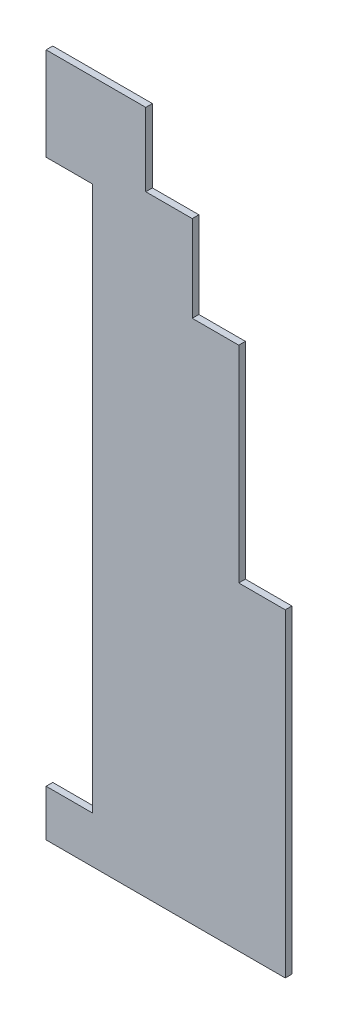
ISO-10303-21;
HEADER;
FILE_DESCRIPTION(('STEP AP214'),'2;1');
FILE_NAME('part.step','',(''),(''),'','','');
FILE_SCHEMA(('AUTOMOTIVE_DESIGN { 1 0 10303 214 1 1 1 1 }'));
ENDSEC;
DATA;
#1=APPLICATION_CONTEXT('core data for automotive mechanical design processes');
#2=APPLICATION_PROTOCOL_DEFINITION('international standard','automotive_design',2000,#1);
#3=PRODUCT_CONTEXT('',#1,'mechanical');
#4=PRODUCT('Part','Part','',(#3));
#5=PRODUCT_RELATED_PRODUCT_CATEGORY('part','',(#4));
#6=PRODUCT_DEFINITION_FORMATION('','',#4);
#7=PRODUCT_DEFINITION_CONTEXT('part definition',#1,'design');
#8=PRODUCT_DEFINITION('design','',#6,#7);
#9=PRODUCT_DEFINITION_SHAPE('','',#8);
#10=(LENGTH_UNIT() NAMED_UNIT(*) SI_UNIT(.MILLI.,.METRE.));
#11=(NAMED_UNIT(*) PLANE_ANGLE_UNIT() SI_UNIT($,.RADIAN.));
#12=(NAMED_UNIT(*) SI_UNIT($,.STERADIAN.) SOLID_ANGLE_UNIT());
#13=UNCERTAINTY_MEASURE_WITH_UNIT(LENGTH_MEASURE(1.E-05),#10,'distance_accuracy_value','');
#14=(GEOMETRIC_REPRESENTATION_CONTEXT(3) GLOBAL_UNCERTAINTY_ASSIGNED_CONTEXT((#13)) GLOBAL_UNIT_ASSIGNED_CONTEXT((#10,
#11,#12)) REPRESENTATION_CONTEXT('',''));
#15=CARTESIAN_POINT('',(0.,0.,0.));
#16=DIRECTION('',(0.,0.,1.));
#17=DIRECTION('',(1.,0.,0.));
#18=AXIS2_PLACEMENT_3D('',#15,#16,#17);
#19=CARTESIAN_POINT('',(0.,103.,1.));
#20=DIRECTION('',(1.,0.,0.));
#21=DIRECTION('',(0.,1.,0.));
#22=AXIS2_PLACEMENT_3D('',#19,#20,#21);
#23=PLANE('',#22);
#24=DIRECTION('',(0.,-1.,0.));
#25=VECTOR('',#24,1.);
#26=CARTESIAN_POINT('',(0.,103.,0.));
#27=LINE('',#26,#25);
#28=CARTESIAN_POINT('',(0.,103.,0.));
#29=VERTEX_POINT('',#28);
#30=CARTESIAN_POINT('',(0.,89.,0.));
#31=VERTEX_POINT('',#30);
#32=EDGE_CURVE('E165',#29,#31,#27,.T.);
#33=ORIENTED_EDGE('',*,*,#32,.T.);
#34=DIRECTION('',(0.,0.,-1.));
#35=VECTOR('',#34,1.);
#36=CARTESIAN_POINT('',(0.,89.,1.));
#37=LINE('',#36,#35);
#38=CARTESIAN_POINT('',(0.,89.,1.));
#39=VERTEX_POINT('',#38);
#40=EDGE_CURVE('E11',#39,#31,#37,.T.);
#41=ORIENTED_EDGE('',*,*,#40,.F.);
#42=DIRECTION('',(0.,-1.,0.));
#43=VECTOR('',#42,1.);
#44=CARTESIAN_POINT('',(0.,103.,1.));
#45=LINE('',#44,#43);
#46=CARTESIAN_POINT('',(0.,103.,1.));
#47=VERTEX_POINT('',#46);
#48=EDGE_CURVE('E191',#47,#39,#45,.T.);
#49=ORIENTED_EDGE('',*,*,#48,.F.);
#50=DIRECTION('',(0.,0.,-1.));
#51=VECTOR('',#50,1.);
#52=CARTESIAN_POINT('',(0.,103.,1.));
#53=LINE('',#52,#51);
#54=EDGE_CURVE('E161',#47,#29,#53,.T.);
#55=ORIENTED_EDGE('',*,*,#54,.T.);
#56=EDGE_LOOP('',(#33,#41,#49,#55));
#57=FACE_BOUND('',#56,.T.);
#58=ADVANCED_FACE('F33',(#57),#23,.F.);
#59=CARTESIAN_POINT('',(0.,89.,1.));
#60=DIRECTION('',(0.,1.,0.));
#61=DIRECTION('',(0.,0.,1.));
#62=AXIS2_PLACEMENT_3D('',#59,#60,#61);
#63=PLANE('',#62);
#64=DIRECTION('',(1.,0.,0.));
#65=VECTOR('',#64,1.);
#66=CARTESIAN_POINT('',(0.,89.,0.));
#67=LINE('',#66,#65);
#68=CARTESIAN_POINT('',(6.99999999999999,89.,0.));
#69=VERTEX_POINT('',#68);
#70=EDGE_CURVE('E168',#31,#69,#67,.T.);
#71=ORIENTED_EDGE('',*,*,#70,.T.);
#72=DIRECTION('',(0.,0.,-1.));
#73=VECTOR('',#72,1.);
#74=CARTESIAN_POINT('',(6.99999999999999,89.,1.));
#75=LINE('',#74,#73);
#76=CARTESIAN_POINT('',(6.99999999999999,89.,1.));
#77=VERTEX_POINT('',#76);
#78=EDGE_CURVE('E41',#77,#69,#75,.T.);
#79=ORIENTED_EDGE('',*,*,#78,.F.);
#80=DIRECTION('',(1.,0.,0.));
#81=VECTOR('',#80,1.);
#82=CARTESIAN_POINT('',(0.,89.,1.));
#83=LINE('',#82,#81);
#84=EDGE_CURVE('E110',#39,#77,#83,.T.);
#85=ORIENTED_EDGE('',*,*,#84,.F.);
#86=ORIENTED_EDGE('',*,*,#40,.T.);
#87=EDGE_LOOP('',(#71,#79,#85,#86));
#88=FACE_BOUND('',#87,.T.);
#89=ADVANCED_FACE('F279',(#88),#63,.F.);
#90=CARTESIAN_POINT('',(6.99999999999999,89.,1.));
#91=DIRECTION('',(1.,0.,0.));
#92=DIRECTION('',(0.,1.,0.));
#93=AXIS2_PLACEMENT_3D('',#90,#91,#92);
#94=PLANE('',#93);
#95=DIRECTION('',(0.,-1.,0.));
#96=VECTOR('',#95,1.);
#97=CARTESIAN_POINT('',(6.99999999999999,89.,0.));
#98=LINE('',#97,#96);
#99=CARTESIAN_POINT('',(7.,7.,0.));
#100=VERTEX_POINT('',#99);
#101=EDGE_CURVE('E170',#69,#100,#98,.T.);
#102=ORIENTED_EDGE('',*,*,#101,.T.);
#103=DIRECTION('',(0.,0.,-1.));
#104=VECTOR('',#103,1.);
#105=CARTESIAN_POINT('',(7.,7.,1.));
#106=LINE('',#105,#104);
#107=CARTESIAN_POINT('',(7.,7.,1.));
#108=VERTEX_POINT('',#107);
#109=EDGE_CURVE('E216',#108,#100,#106,.T.);
#110=ORIENTED_EDGE('',*,*,#109,.F.);
#111=DIRECTION('',(0.,-1.,0.));
#112=VECTOR('',#111,1.);
#113=CARTESIAN_POINT('',(6.99999999999999,89.,1.));
#114=LINE('',#113,#112);
#115=EDGE_CURVE('E224',#77,#108,#114,.T.);
#116=ORIENTED_EDGE('',*,*,#115,.F.);
#117=ORIENTED_EDGE('',*,*,#78,.T.);
#118=EDGE_LOOP('',(#102,#110,#116,#117));
#119=FACE_BOUND('',#118,.T.);
#120=ADVANCED_FACE('F222',(#119),#94,.F.);
#121=CARTESIAN_POINT('',(7.,7.,1.));
#122=DIRECTION('',(0.,-1.,0.));
#123=DIRECTION('',(1.,0.,0.));
#124=AXIS2_PLACEMENT_3D('',#121,#122,#123);
#125=PLANE('',#124);
#126=DIRECTION('',(-1.,0.,0.));
#127=VECTOR('',#126,1.);
#128=CARTESIAN_POINT('',(7.,7.,0.));
#129=LINE('',#128,#127);
#130=CARTESIAN_POINT('',(0.,7.,0.));
#131=VERTEX_POINT('',#130);
#132=EDGE_CURVE('E172',#100,#131,#129,.T.);
#133=ORIENTED_EDGE('',*,*,#132,.T.);
#134=DIRECTION('',(0.,0.,-1.));
#135=VECTOR('',#134,1.);
#136=CARTESIAN_POINT('',(0.,7.,1.));
#137=LINE('',#136,#135);
#138=CARTESIAN_POINT('',(0.,7.,1.));
#139=VERTEX_POINT('',#138);
#140=EDGE_CURVE('E213',#139,#131,#137,.T.);
#141=ORIENTED_EDGE('',*,*,#140,.F.);
#142=DIRECTION('',(-1.,0.,0.));
#143=VECTOR('',#142,1.);
#144=CARTESIAN_POINT('',(7.,7.,1.));
#145=LINE('',#144,#143);
#146=EDGE_CURVE('E242',#108,#139,#145,.T.);
#147=ORIENTED_EDGE('',*,*,#146,.F.);
#148=ORIENTED_EDGE('',*,*,#109,.T.);
#149=EDGE_LOOP('',(#133,#141,#147,#148));
#150=FACE_BOUND('',#149,.T.);
#151=ADVANCED_FACE('F233',(#150),#125,.F.);
#152=CARTESIAN_POINT('',(0.,7.,1.));
#153=DIRECTION('',(1.,0.,0.));
#154=DIRECTION('',(0.,1.,0.));
#155=AXIS2_PLACEMENT_3D('',#152,#153,#154);
#156=PLANE('',#155);
#157=DIRECTION('',(0.,-1.,0.));
#158=VECTOR('',#157,1.);
#159=CARTESIAN_POINT('',(0.,7.,0.));
#160=LINE('',#159,#158);
#161=CARTESIAN_POINT('',(0.,0.,0.));
#162=VERTEX_POINT('',#161);
#163=EDGE_CURVE('E174',#131,#162,#160,.T.);
#164=ORIENTED_EDGE('',*,*,#163,.T.);
#165=DIRECTION('',(0.,0.,-1.));
#166=VECTOR('',#165,1.);
#167=CARTESIAN_POINT('',(0.,0.,1.));
#168=LINE('',#167,#166);
#169=CARTESIAN_POINT('',(0.,0.,1.));
#170=VERTEX_POINT('',#169);
#171=EDGE_CURVE('E210',#170,#162,#168,.T.);
#172=ORIENTED_EDGE('',*,*,#171,.F.);
#173=DIRECTION('',(0.,-1.,0.));
#174=VECTOR('',#173,1.);
#175=CARTESIAN_POINT('',(0.,7.,1.));
#176=LINE('',#175,#174);
#177=EDGE_CURVE('E239',#139,#170,#176,.T.);
#178=ORIENTED_EDGE('',*,*,#177,.F.);
#179=ORIENTED_EDGE('',*,*,#140,.T.);
#180=EDGE_LOOP('',(#164,#172,#178,#179));
#181=FACE_BOUND('',#180,.T.);
#182=ADVANCED_FACE('F237',(#181),#156,.F.);
#183=CARTESIAN_POINT('',(36.,0.,1.));
#184=DIRECTION('',(0.,1.,0.));
#185=DIRECTION('',(-1.,0.,0.));
#186=AXIS2_PLACEMENT_3D('',#183,#184,#185);
#187=PLANE('',#186);
#188=DIRECTION('',(1.,0.,0.));
#189=VECTOR('',#188,1.);
#190=CARTESIAN_POINT('',(36.,0.,0.));
#191=LINE('',#190,#189);
#192=CARTESIAN_POINT('',(36.,0.,0.));
#193=VERTEX_POINT('',#192);
#194=EDGE_CURVE('E176',#162,#193,#191,.T.);
#195=ORIENTED_EDGE('',*,*,#194,.T.);
#196=DIRECTION('',(0.,0.,-1.));
#197=VECTOR('',#196,1.);
#198=CARTESIAN_POINT('',(36.,0.,1.));
#199=LINE('',#198,#197);
#200=CARTESIAN_POINT('',(36.,0.,1.));
#201=VERTEX_POINT('',#200);
#202=EDGE_CURVE('E207',#201,#193,#199,.T.);
#203=ORIENTED_EDGE('',*,*,#202,.F.);
#204=DIRECTION('',(1.,0.,0.));
#205=VECTOR('',#204,1.);
#206=CARTESIAN_POINT('',(36.,0.,1.));
#207=LINE('',#206,#205);
#208=EDGE_CURVE('E241',#170,#201,#207,.T.);
#209=ORIENTED_EDGE('',*,*,#208,.F.);
#210=ORIENTED_EDGE('',*,*,#171,.T.);
#211=EDGE_LOOP('',(#195,#203,#209,#210));
#212=FACE_BOUND('',#211,.T.);
#213=ADVANCED_FACE('F292',(#212),#187,.F.);
#214=CARTESIAN_POINT('',(36.,48.,1.));
#215=DIRECTION('',(-1.,0.,0.));
#216=DIRECTION('',(0.,0.,1.));
#217=AXIS2_PLACEMENT_3D('',#214,#215,#216);
#218=PLANE('',#217);
#219=DIRECTION('',(0.,1.,0.));
#220=VECTOR('',#219,1.);
#221=CARTESIAN_POINT('',(36.,48.,0.));
#222=LINE('',#221,#220);
#223=CARTESIAN_POINT('',(36.,48.,0.));
#224=VERTEX_POINT('',#223);
#225=EDGE_CURVE('E178',#193,#224,#222,.T.);
#226=ORIENTED_EDGE('',*,*,#225,.T.);
#227=DIRECTION('',(0.,0.,-1.));
#228=VECTOR('',#227,1.);
#229=CARTESIAN_POINT('',(36.,48.,1.));
#230=LINE('',#229,#228);
#231=CARTESIAN_POINT('',(36.,48.,1.));
#232=VERTEX_POINT('',#231);
#233=EDGE_CURVE('E204',#232,#224,#230,.T.);
#234=ORIENTED_EDGE('',*,*,#233,.F.);
#235=DIRECTION('',(0.,1.,0.));
#236=VECTOR('',#235,1.);
#237=CARTESIAN_POINT('',(36.,48.,1.));
#238=LINE('',#237,#236);
#239=EDGE_CURVE('E244',#201,#232,#238,.T.);
#240=ORIENTED_EDGE('',*,*,#239,.F.);
#241=ORIENTED_EDGE('',*,*,#202,.T.);
#242=EDGE_LOOP('',(#226,#234,#240,#241));
#243=FACE_BOUND('',#242,.T.);
#244=ADVANCED_FACE('F295',(#243),#218,.F.);
#245=CARTESIAN_POINT('',(29.,48.,1.));
#246=DIRECTION('',(0.,-1.,0.));
#247=DIRECTION('',(0.,0.,-1.));
#248=AXIS2_PLACEMENT_3D('',#245,#246,#247);
#249=PLANE('',#248);
#250=DIRECTION('',(-1.,0.,0.));
#251=VECTOR('',#250,1.);
#252=CARTESIAN_POINT('',(29.,48.,0.));
#253=LINE('',#252,#251);
#254=CARTESIAN_POINT('',(29.,48.,0.));
#255=VERTEX_POINT('',#254);
#256=EDGE_CURVE('E180',#224,#255,#253,.T.);
#257=ORIENTED_EDGE('',*,*,#256,.T.);
#258=DIRECTION('',(0.,0.,-1.));
#259=VECTOR('',#258,1.);
#260=CARTESIAN_POINT('',(29.,48.,1.));
#261=LINE('',#260,#259);
#262=CARTESIAN_POINT('',(29.,48.,1.));
#263=VERTEX_POINT('',#262);
#264=EDGE_CURVE('E201',#263,#255,#261,.T.);
#265=ORIENTED_EDGE('',*,*,#264,.F.);
#266=DIRECTION('',(-1.,0.,0.));
#267=VECTOR('',#266,1.);
#268=CARTESIAN_POINT('',(29.,48.,1.));
#269=LINE('',#268,#267);
#270=EDGE_CURVE('E250',#232,#263,#269,.T.);
#271=ORIENTED_EDGE('',*,*,#270,.F.);
#272=ORIENTED_EDGE('',*,*,#233,.T.);
#273=EDGE_LOOP('',(#257,#265,#271,#272));
#274=FACE_BOUND('',#273,.T.);
#275=ADVANCED_FACE('F299',(#274),#249,.F.);
#276=CARTESIAN_POINT('',(29.,79.,1.));
#277=DIRECTION('',(-1.,0.,0.));
#278=DIRECTION('',(0.,-1.,0.));
#279=AXIS2_PLACEMENT_3D('',#276,#277,#278);
#280=PLANE('',#279);
#281=DIRECTION('',(0.,1.,0.));
#282=VECTOR('',#281,1.);
#283=CARTESIAN_POINT('',(29.,79.,0.));
#284=LINE('',#283,#282);
#285=CARTESIAN_POINT('',(29.,79.,0.));
#286=VERTEX_POINT('',#285);
#287=EDGE_CURVE('E182',#255,#286,#284,.T.);
#288=ORIENTED_EDGE('',*,*,#287,.T.);
#289=DIRECTION('',(0.,0.,-1.));
#290=VECTOR('',#289,1.);
#291=CARTESIAN_POINT('',(29.,79.,1.));
#292=LINE('',#291,#290);
#293=CARTESIAN_POINT('',(29.,79.,1.));
#294=VERTEX_POINT('',#293);
#295=EDGE_CURVE('E198',#294,#286,#292,.T.);
#296=ORIENTED_EDGE('',*,*,#295,.F.);
#297=DIRECTION('',(0.,1.,0.));
#298=VECTOR('',#297,1.);
#299=CARTESIAN_POINT('',(29.,79.,1.));
#300=LINE('',#299,#298);
#301=EDGE_CURVE('E252',#263,#294,#300,.T.);
#302=ORIENTED_EDGE('',*,*,#301,.F.);
#303=ORIENTED_EDGE('',*,*,#264,.T.);
#304=EDGE_LOOP('',(#288,#296,#302,#303));
#305=FACE_BOUND('',#304,.T.);
#306=ADVANCED_FACE('F303',(#305),#280,.F.);
#307=CARTESIAN_POINT('',(22.,79.,1.));
#308=DIRECTION('',(0.,-1.,0.));
#309=DIRECTION('',(1.,0.,0.));
#310=AXIS2_PLACEMENT_3D('',#307,#308,#309);
#311=PLANE('',#310);
#312=DIRECTION('',(-1.,0.,0.));
#313=VECTOR('',#312,1.);
#314=CARTESIAN_POINT('',(22.,79.,0.));
#315=LINE('',#314,#313);
#316=CARTESIAN_POINT('',(22.,79.,0.));
#317=VERTEX_POINT('',#316);
#318=EDGE_CURVE('E184',#286,#317,#315,.T.);
#319=ORIENTED_EDGE('',*,*,#318,.T.);
#320=DIRECTION('',(0.,0.,-1.));
#321=VECTOR('',#320,1.);
#322=CARTESIAN_POINT('',(22.,79.,1.));
#323=LINE('',#322,#321);
#324=CARTESIAN_POINT('',(22.,79.,1.));
#325=VERTEX_POINT('',#324);
#326=EDGE_CURVE('E195',#325,#317,#323,.T.);
#327=ORIENTED_EDGE('',*,*,#326,.F.);
#328=DIRECTION('',(-1.,0.,0.));
#329=VECTOR('',#328,1.);
#330=CARTESIAN_POINT('',(22.,79.,1.));
#331=LINE('',#330,#329);
#332=EDGE_CURVE('E254',#294,#325,#331,.T.);
#333=ORIENTED_EDGE('',*,*,#332,.F.);
#334=ORIENTED_EDGE('',*,*,#295,.T.);
#335=EDGE_LOOP('',(#319,#327,#333,#334));
#336=FACE_BOUND('',#335,.T.);
#337=ADVANCED_FACE('F260',(#336),#311,.F.);
#338=CARTESIAN_POINT('',(22.,92.,1.));
#339=DIRECTION('',(-1.,0.,0.));
#340=DIRECTION('',(0.,-1.,0.));
#341=AXIS2_PLACEMENT_3D('',#338,#339,#340);
#342=PLANE('',#341);
#343=DIRECTION('',(0.,1.,0.));
#344=VECTOR('',#343,1.);
#345=CARTESIAN_POINT('',(22.,92.,0.));
#346=LINE('',#345,#344);
#347=CARTESIAN_POINT('',(22.,92.,0.));
#348=VERTEX_POINT('',#347);
#349=EDGE_CURVE('E186',#317,#348,#346,.T.);
#350=ORIENTED_EDGE('',*,*,#349,.T.);
#351=DIRECTION('',(0.,0.,-1.));
#352=VECTOR('',#351,1.);
#353=CARTESIAN_POINT('',(22.,92.,1.));
#354=LINE('',#353,#352);
#355=CARTESIAN_POINT('',(22.,92.,1.));
#356=VERTEX_POINT('',#355);
#357=EDGE_CURVE('E156',#356,#348,#354,.T.);
#358=ORIENTED_EDGE('',*,*,#357,.F.);
#359=DIRECTION('',(0.,1.,0.));
#360=VECTOR('',#359,1.);
#361=CARTESIAN_POINT('',(22.,92.,1.));
#362=LINE('',#361,#360);
#363=EDGE_CURVE('E147',#325,#356,#362,.T.);
#364=ORIENTED_EDGE('',*,*,#363,.F.);
#365=ORIENTED_EDGE('',*,*,#326,.T.);
#366=EDGE_LOOP('',(#350,#358,#364,#365));
#367=FACE_BOUND('',#366,.T.);
#368=ADVANCED_FACE('F264',(#367),#342,.F.);
#369=CARTESIAN_POINT('',(15.,92.,1.));
#370=DIRECTION('',(0.,-1.,0.));
#371=DIRECTION('',(0.,0.,-1.));
#372=AXIS2_PLACEMENT_3D('',#369,#370,#371);
#373=PLANE('',#372);
#374=DIRECTION('',(-1.,0.,0.));
#375=VECTOR('',#374,1.);
#376=CARTESIAN_POINT('',(15.,92.,0.));
#377=LINE('',#376,#375);
#378=CARTESIAN_POINT('',(15.,92.,0.));
#379=VERTEX_POINT('',#378);
#380=EDGE_CURVE('E155',#348,#379,#377,.T.);
#381=ORIENTED_EDGE('',*,*,#380,.T.);
#382=DIRECTION('',(0.,0.,-1.));
#383=VECTOR('',#382,1.);
#384=CARTESIAN_POINT('',(15.,92.,1.));
#385=LINE('',#384,#383);
#386=CARTESIAN_POINT('',(15.,92.,1.));
#387=VERTEX_POINT('',#386);
#388=EDGE_CURVE('E152',#387,#379,#385,.T.);
#389=ORIENTED_EDGE('',*,*,#388,.F.);
#390=DIRECTION('',(-1.,0.,0.));
#391=VECTOR('',#390,1.);
#392=CARTESIAN_POINT('',(15.,92.,1.));
#393=LINE('',#392,#391);
#394=EDGE_CURVE('E141',#356,#387,#393,.T.);
#395=ORIENTED_EDGE('',*,*,#394,.F.);
#396=ORIENTED_EDGE('',*,*,#357,.T.);
#397=EDGE_LOOP('',(#381,#389,#395,#396));
#398=FACE_BOUND('',#397,.T.);
#399=ADVANCED_FACE('F153',(#398),#373,.F.);
#400=CARTESIAN_POINT('',(15.,103.,1.));
#401=DIRECTION('',(-1.,0.,0.));
#402=DIRECTION('',(0.,-1.,0.));
#403=AXIS2_PLACEMENT_3D('',#400,#401,#402);
#404=PLANE('',#403);
#405=DIRECTION('',(0.,1.,0.));
#406=VECTOR('',#405,1.);
#407=CARTESIAN_POINT('',(15.,103.,0.));
#408=LINE('',#407,#406);
#409=CARTESIAN_POINT('',(15.,103.,0.));
#410=VERTEX_POINT('',#409);
#411=EDGE_CURVE('E96',#379,#410,#408,.T.);
#412=ORIENTED_EDGE('',*,*,#411,.T.);
#413=DIRECTION('',(0.,0.,-1.));
#414=VECTOR('',#413,1.);
#415=CARTESIAN_POINT('',(15.,103.,1.));
#416=LINE('',#415,#414);
#417=CARTESIAN_POINT('',(15.,103.,1.));
#418=VERTEX_POINT('',#417);
#419=EDGE_CURVE('E157',#418,#410,#416,.T.);
#420=ORIENTED_EDGE('',*,*,#419,.F.);
#421=DIRECTION('',(0.,1.,0.));
#422=VECTOR('',#421,1.);
#423=CARTESIAN_POINT('',(15.,103.,1.));
#424=LINE('',#423,#422);
#425=EDGE_CURVE('E145',#387,#418,#424,.T.);
#426=ORIENTED_EDGE('',*,*,#425,.F.);
#427=ORIENTED_EDGE('',*,*,#388,.T.);
#428=EDGE_LOOP('',(#412,#420,#426,#427));
#429=FACE_BOUND('',#428,.T.);
#430=ADVANCED_FACE('F159',(#429),#404,.F.);
#431=CARTESIAN_POINT('',(0.,103.,1.));
#432=DIRECTION('',(0.,-1.,0.));
#433=DIRECTION('',(1.,0.,0.));
#434=AXIS2_PLACEMENT_3D('',#431,#432,#433);
#435=PLANE('',#434);
#436=DIRECTION('',(-1.,0.,0.));
#437=VECTOR('',#436,1.);
#438=CARTESIAN_POINT('',(0.,103.,0.));
#439=LINE('',#438,#437);
#440=EDGE_CURVE('E102',#410,#29,#439,.T.);
#441=ORIENTED_EDGE('',*,*,#440,.T.);
#442=ORIENTED_EDGE('',*,*,#54,.F.);
#443=DIRECTION('',(-1.,0.,0.));
#444=VECTOR('',#443,1.);
#445=CARTESIAN_POINT('',(0.,103.,1.));
#446=LINE('',#445,#444);
#447=EDGE_CURVE('E49',#418,#47,#446,.T.);
#448=ORIENTED_EDGE('',*,*,#447,.F.);
#449=ORIENTED_EDGE('',*,*,#419,.T.);
#450=EDGE_LOOP('',(#441,#442,#448,#449));
#451=FACE_BOUND('',#450,.T.);
#452=ADVANCED_FACE('F268',(#451),#435,.F.);
#453=CARTESIAN_POINT('',(0.,0.,1.));
#454=DIRECTION('',(0.,0.,1.));
#455=DIRECTION('',(1.,0.,0.));
#456=AXIS2_PLACEMENT_3D('',#453,#454,#455);
#457=PLANE('',#456);
#458=ORIENTED_EDGE('',*,*,#48,.T.);
#459=ORIENTED_EDGE('',*,*,#84,.T.);
#460=ORIENTED_EDGE('',*,*,#115,.T.);
#461=ORIENTED_EDGE('',*,*,#146,.T.);
#462=ORIENTED_EDGE('',*,*,#177,.T.);
#463=ORIENTED_EDGE('',*,*,#208,.T.);
#464=ORIENTED_EDGE('',*,*,#239,.T.);
#465=ORIENTED_EDGE('',*,*,#270,.T.);
#466=ORIENTED_EDGE('',*,*,#301,.T.);
#467=ORIENTED_EDGE('',*,*,#332,.T.);
#468=ORIENTED_EDGE('',*,*,#363,.T.);
#469=ORIENTED_EDGE('',*,*,#394,.T.);
#470=ORIENTED_EDGE('',*,*,#425,.T.);
#471=ORIENTED_EDGE('',*,*,#447,.T.);
#472=EDGE_LOOP('',(#458,#459,#460,#461,#462,#463,#464,#465,#466,#467,#468,#469,#470,#471));
#473=FACE_BOUND('',#472,.T.);
#474=ADVANCED_FACE('F143',(#473),#457,.T.);
#475=CARTESIAN_POINT('',(0.,0.,0.));
#476=DIRECTION('',(0.,0.,1.));
#477=DIRECTION('',(1.,0.,0.));
#478=AXIS2_PLACEMENT_3D('',#475,#476,#477);
#479=PLANE('',#478);
#480=ORIENTED_EDGE('',*,*,#32,.F.);
#481=ORIENTED_EDGE('',*,*,#440,.F.);
#482=ORIENTED_EDGE('',*,*,#411,.F.);
#483=ORIENTED_EDGE('',*,*,#380,.F.);
#484=ORIENTED_EDGE('',*,*,#349,.F.);
#485=ORIENTED_EDGE('',*,*,#318,.F.);
#486=ORIENTED_EDGE('',*,*,#287,.F.);
#487=ORIENTED_EDGE('',*,*,#256,.F.);
#488=ORIENTED_EDGE('',*,*,#225,.F.);
#489=ORIENTED_EDGE('',*,*,#194,.F.);
#490=ORIENTED_EDGE('',*,*,#163,.F.);
#491=ORIENTED_EDGE('',*,*,#132,.F.);
#492=ORIENTED_EDGE('',*,*,#101,.F.);
#493=ORIENTED_EDGE('',*,*,#70,.F.);
#494=EDGE_LOOP('',(#480,#481,#482,#483,#484,#485,#486,#487,#488,#489,#490,#491,#492,#493));
#495=FACE_BOUND('',#494,.T.);
#496=ADVANCED_FACE('F228',(#495),#479,.F.);
#497=CLOSED_SHELL('',(#58,#89,#120,#151,#182,#213,#244,#275,#306,#337,#368,#399,#430,#452,#474,#496));
#498=MANIFOLD_SOLID_BREP('B2',#497);
#499=ADVANCED_BREP_SHAPE_REPRESENTATION('',(#18,#498),#14);
#500=SHAPE_DEFINITION_REPRESENTATION(#9,#499);
ENDSEC;
END-ISO-10303-21;
